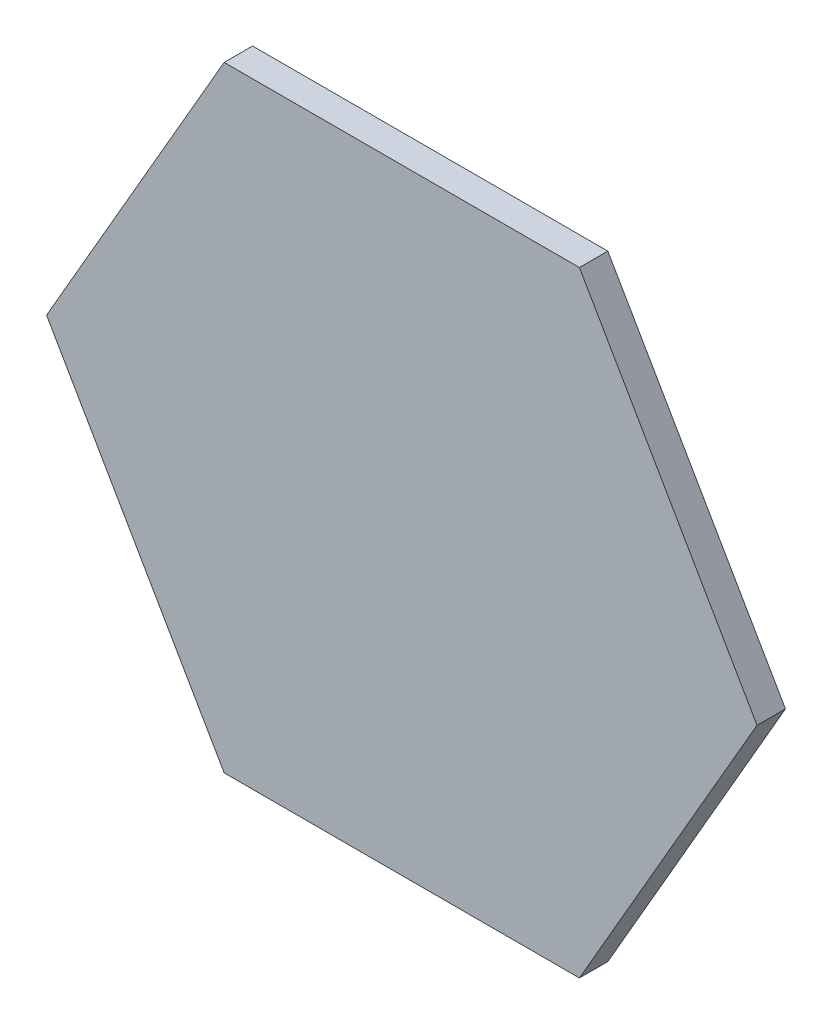
ISO-10303-21;
HEADER;
FILE_DESCRIPTION(('STEP AP214'),'2;1');
FILE_NAME('part.step','',(''),(''),'','','');
FILE_SCHEMA(('AUTOMOTIVE_DESIGN { 1 0 10303 214 1 1 1 1 }'));
ENDSEC;
DATA;
#1=APPLICATION_CONTEXT('core data for automotive mechanical design processes');
#2=APPLICATION_PROTOCOL_DEFINITION('international standard','automotive_design',2000,#1);
#3=PRODUCT_CONTEXT('',#1,'mechanical');
#4=PRODUCT('Part','Part','',(#3));
#5=PRODUCT_RELATED_PRODUCT_CATEGORY('part','',(#4));
#6=PRODUCT_DEFINITION_FORMATION('','',#4);
#7=PRODUCT_DEFINITION_CONTEXT('part definition',#1,'design');
#8=PRODUCT_DEFINITION('design','',#6,#7);
#9=PRODUCT_DEFINITION_SHAPE('','',#8);
#10=(LENGTH_UNIT() NAMED_UNIT(*) SI_UNIT(.MILLI.,.METRE.));
#11=(NAMED_UNIT(*) PLANE_ANGLE_UNIT() SI_UNIT($,.RADIAN.));
#12=(NAMED_UNIT(*) SI_UNIT($,.STERADIAN.) SOLID_ANGLE_UNIT());
#13=UNCERTAINTY_MEASURE_WITH_UNIT(LENGTH_MEASURE(1.E-05),#10,'distance_accuracy_value','');
#14=(GEOMETRIC_REPRESENTATION_CONTEXT(3) GLOBAL_UNCERTAINTY_ASSIGNED_CONTEXT((#13)) GLOBAL_UNIT_ASSIGNED_CONTEXT((#10,
#11,#12)) REPRESENTATION_CONTEXT('',''));
#15=CARTESIAN_POINT('',(0.,0.,0.));
#16=DIRECTION('',(0.,0.,1.));
#17=DIRECTION('',(1.,0.,0.));
#18=AXIS2_PLACEMENT_3D('',#15,#16,#17);
#19=CARTESIAN_POINT('',(-0.5,0.866025403784438,0.08));
#20=DIRECTION('',(0.866025403784439,-0.5,0.));
#21=DIRECTION('',(0.5,0.866025403784439,0.));
#22=AXIS2_PLACEMENT_3D('',#19,#20,#21);
#23=PLANE('',#22);
#24=DIRECTION('',(-0.5,-0.866025403784439,0.));
#25=VECTOR('',#24,1.);
#26=CARTESIAN_POINT('',(-0.5,0.866025403784438,0.));
#27=LINE('',#26,#25);
#28=CARTESIAN_POINT('',(-0.5,0.866025403784438,0.));
#29=VERTEX_POINT('',#28);
#30=CARTESIAN_POINT('',(-1.,0.,0.));
#31=VERTEX_POINT('',#30);
#32=EDGE_CURVE('E117',#29,#31,#27,.T.);
#33=ORIENTED_EDGE('',*,*,#32,.T.);
#34=DIRECTION('',(0.,0.,-1.));
#35=VECTOR('',#34,1.);
#36=CARTESIAN_POINT('',(-1.,0.,0.08));
#37=LINE('',#36,#35);
#38=CARTESIAN_POINT('',(-1.,0.,0.08));
#39=VERTEX_POINT('',#38);
#40=EDGE_CURVE('E11',#39,#31,#37,.T.);
#41=ORIENTED_EDGE('',*,*,#40,.F.);
#42=DIRECTION('',(-0.5,-0.866025403784439,0.));
#43=VECTOR('',#42,1.);
#44=CARTESIAN_POINT('',(-0.5,0.866025403784438,0.08));
#45=LINE('',#44,#43);
#46=CARTESIAN_POINT('',(-0.5,0.866025403784438,0.08));
#47=VERTEX_POINT('',#46);
#48=EDGE_CURVE('E127',#47,#39,#45,.T.);
#49=ORIENTED_EDGE('',*,*,#48,.F.);
#50=DIRECTION('',(0.,0.,-1.));
#51=VECTOR('',#50,1.);
#52=CARTESIAN_POINT('',(-0.5,0.866025403784438,0.08));
#53=LINE('',#52,#51);
#54=EDGE_CURVE('E113',#47,#29,#53,.T.);
#55=ORIENTED_EDGE('',*,*,#54,.T.);
#56=EDGE_LOOP('',(#33,#41,#49,#55));
#57=FACE_BOUND('',#56,.T.);
#58=ADVANCED_FACE('F33',(#57),#23,.F.);
#59=CARTESIAN_POINT('',(-1.,0.,0.08));
#60=DIRECTION('',(0.866025403784438,0.5,0.));
#61=DIRECTION('',(-0.5,0.866025403784438,0.));
#62=AXIS2_PLACEMENT_3D('',#59,#60,#61);
#63=PLANE('',#62);
#64=DIRECTION('',(0.5,-0.866025403784438,0.));
#65=VECTOR('',#64,1.);
#66=CARTESIAN_POINT('',(-1.,0.,0.));
#67=LINE('',#66,#65);
#68=CARTESIAN_POINT('',(-0.499999999999999,-0.866025403784439,0.));
#69=VERTEX_POINT('',#68);
#70=EDGE_CURVE('E120',#31,#69,#67,.T.);
#71=ORIENTED_EDGE('',*,*,#70,.T.);
#72=DIRECTION('',(0.,0.,-1.));
#73=VECTOR('',#72,1.);
#74=CARTESIAN_POINT('',(-0.499999999999999,-0.866025403784439,0.08));
#75=LINE('',#74,#73);
#76=CARTESIAN_POINT('',(-0.499999999999999,-0.866025403784439,0.08));
#77=VERTEX_POINT('',#76);
#78=EDGE_CURVE('E41',#77,#69,#75,.T.);
#79=ORIENTED_EDGE('',*,*,#78,.F.);
#80=DIRECTION('',(0.5,-0.866025403784438,0.));
#81=VECTOR('',#80,1.);
#82=CARTESIAN_POINT('',(-1.,0.,0.08));
#83=LINE('',#82,#81);
#84=EDGE_CURVE('E86',#39,#77,#83,.T.);
#85=ORIENTED_EDGE('',*,*,#84,.F.);
#86=ORIENTED_EDGE('',*,*,#40,.T.);
#87=EDGE_LOOP('',(#71,#79,#85,#86));
#88=FACE_BOUND('',#87,.T.);
#89=ADVANCED_FACE('F151',(#88),#63,.F.);
#90=CARTESIAN_POINT('',(-0.499999999999999,-0.866025403784439,0.08));
#91=DIRECTION('',(0.,1.,0.));
#92=DIRECTION('',(-1.,0.,0.));
#93=AXIS2_PLACEMENT_3D('',#90,#91,#92);
#94=PLANE('',#93);
#95=DIRECTION('',(1.,0.,0.));
#96=VECTOR('',#95,1.);
#97=CARTESIAN_POINT('',(-0.499999999999999,-0.866025403784439,0.));
#98=LINE('',#97,#96);
#99=CARTESIAN_POINT('',(0.5,-0.866025403784439,0.));
#100=VERTEX_POINT('',#99);
#101=EDGE_CURVE('E122',#69,#100,#98,.T.);
#102=ORIENTED_EDGE('',*,*,#101,.T.);
#103=DIRECTION('',(0.,0.,-1.));
#104=VECTOR('',#103,1.);
#105=CARTESIAN_POINT('',(0.5,-0.866025403784439,0.08));
#106=LINE('',#105,#104);
#107=CARTESIAN_POINT('',(0.5,-0.866025403784439,0.08));
#108=VERTEX_POINT('',#107);
#109=EDGE_CURVE('E108',#108,#100,#106,.T.);
#110=ORIENTED_EDGE('',*,*,#109,.F.);
#111=DIRECTION('',(1.,0.,0.));
#112=VECTOR('',#111,1.);
#113=CARTESIAN_POINT('',(-0.499999999999999,-0.866025403784439,0.08));
#114=LINE('',#113,#112);
#115=EDGE_CURVE('E99',#77,#108,#114,.T.);
#116=ORIENTED_EDGE('',*,*,#115,.F.);
#117=ORIENTED_EDGE('',*,*,#78,.T.);
#118=EDGE_LOOP('',(#102,#110,#116,#117));
#119=FACE_BOUND('',#118,.T.);
#120=ADVANCED_FACE('F133',(#119),#94,.F.);
#121=CARTESIAN_POINT('',(0.5,-0.866025403784439,0.08));
#122=DIRECTION('',(-0.866025403784439,0.5,0.));
#123=DIRECTION('',(-0.5,-0.866025403784439,0.));
#124=AXIS2_PLACEMENT_3D('',#121,#122,#123);
#125=PLANE('',#124);
#126=DIRECTION('',(0.5,0.866025403784439,0.));
#127=VECTOR('',#126,1.);
#128=CARTESIAN_POINT('',(0.5,-0.866025403784439,0.));
#129=LINE('',#128,#127);
#130=CARTESIAN_POINT('',(1.,0.,0.));
#131=VERTEX_POINT('',#130);
#132=EDGE_CURVE('E107',#100,#131,#129,.T.);
#133=ORIENTED_EDGE('',*,*,#132,.T.);
#134=DIRECTION('',(0.,0.,-1.));
#135=VECTOR('',#134,1.);
#136=CARTESIAN_POINT('',(1.,0.,0.08));
#137=LINE('',#136,#135);
#138=CARTESIAN_POINT('',(1.,0.,0.08));
#139=VERTEX_POINT('',#138);
#140=EDGE_CURVE('E104',#139,#131,#137,.T.);
#141=ORIENTED_EDGE('',*,*,#140,.F.);
#142=DIRECTION('',(0.5,0.866025403784439,0.));
#143=VECTOR('',#142,1.);
#144=CARTESIAN_POINT('',(0.5,-0.866025403784439,0.08));
#145=LINE('',#144,#143);
#146=EDGE_CURVE('E93',#108,#139,#145,.T.);
#147=ORIENTED_EDGE('',*,*,#146,.F.);
#148=ORIENTED_EDGE('',*,*,#109,.T.);
#149=EDGE_LOOP('',(#133,#141,#147,#148));
#150=FACE_BOUND('',#149,.T.);
#151=ADVANCED_FACE('F105',(#150),#125,.F.);
#152=CARTESIAN_POINT('',(1.,0.,0.08));
#153=DIRECTION('',(-0.866025403784439,-0.5,0.));
#154=DIRECTION('',(0.5,-0.866025403784439,0.));
#155=AXIS2_PLACEMENT_3D('',#152,#153,#154);
#156=PLANE('',#155);
#157=DIRECTION('',(-0.5,0.866025403784439,0.));
#158=VECTOR('',#157,1.);
#159=CARTESIAN_POINT('',(1.,0.,0.));
#160=LINE('',#159,#158);
#161=CARTESIAN_POINT('',(0.5,0.866025403784438,0.));
#162=VERTEX_POINT('',#161);
#163=EDGE_CURVE('E72',#131,#162,#160,.T.);
#164=ORIENTED_EDGE('',*,*,#163,.T.);
#165=DIRECTION('',(0.,0.,-1.));
#166=VECTOR('',#165,1.);
#167=CARTESIAN_POINT('',(0.5,0.866025403784438,0.08));
#168=LINE('',#167,#166);
#169=CARTESIAN_POINT('',(0.5,0.866025403784438,0.08));
#170=VERTEX_POINT('',#169);
#171=EDGE_CURVE('E109',#170,#162,#168,.T.);
#172=ORIENTED_EDGE('',*,*,#171,.F.);
#173=DIRECTION('',(-0.5,0.866025403784439,0.));
#174=VECTOR('',#173,1.);
#175=CARTESIAN_POINT('',(1.,0.,0.08));
#176=LINE('',#175,#174);
#177=EDGE_CURVE('E97',#139,#170,#176,.T.);
#178=ORIENTED_EDGE('',*,*,#177,.F.);
#179=ORIENTED_EDGE('',*,*,#140,.T.);
#180=EDGE_LOOP('',(#164,#172,#178,#179));
#181=FACE_BOUND('',#180,.T.);
#182=ADVANCED_FACE('F111',(#181),#156,.F.);
#183=CARTESIAN_POINT('',(0.5,0.866025403784438,0.08));
#184=DIRECTION('',(0.,-1.,0.));
#185=DIRECTION('',(0.,0.,-1.));
#186=AXIS2_PLACEMENT_3D('',#183,#184,#185);
#187=PLANE('',#186);
#188=DIRECTION('',(-1.,0.,0.));
#189=VECTOR('',#188,1.);
#190=CARTESIAN_POINT('',(0.5,0.866025403784438,0.));
#191=LINE('',#190,#189);
#192=EDGE_CURVE('E78',#162,#29,#191,.T.);
#193=ORIENTED_EDGE('',*,*,#192,.T.);
#194=ORIENTED_EDGE('',*,*,#54,.F.);
#195=DIRECTION('',(-1.,0.,0.));
#196=VECTOR('',#195,1.);
#197=CARTESIAN_POINT('',(0.5,0.866025403784438,0.08));
#198=LINE('',#197,#196);
#199=EDGE_CURVE('E49',#170,#47,#198,.T.);
#200=ORIENTED_EDGE('',*,*,#199,.F.);
#201=ORIENTED_EDGE('',*,*,#171,.T.);
#202=EDGE_LOOP('',(#193,#194,#200,#201));
#203=FACE_BOUND('',#202,.T.);
#204=ADVANCED_FACE('F140',(#203),#187,.F.);
#205=CARTESIAN_POINT('',(0.,0.,0.08));
#206=DIRECTION('',(0.,0.,1.));
#207=DIRECTION('',(1.,0.,0.));
#208=AXIS2_PLACEMENT_3D('',#205,#206,#207);
#209=PLANE('',#208);
#210=ORIENTED_EDGE('',*,*,#48,.T.);
#211=ORIENTED_EDGE('',*,*,#84,.T.);
#212=ORIENTED_EDGE('',*,*,#115,.T.);
#213=ORIENTED_EDGE('',*,*,#146,.T.);
#214=ORIENTED_EDGE('',*,*,#177,.T.);
#215=ORIENTED_EDGE('',*,*,#199,.T.);
#216=EDGE_LOOP('',(#210,#211,#212,#213,#214,#215));
#217=FACE_BOUND('',#216,.T.);
#218=ADVANCED_FACE('F95',(#217),#209,.T.);
#219=CARTESIAN_POINT('',(0.,0.,0.));
#220=DIRECTION('',(0.,0.,1.));
#221=DIRECTION('',(1.,0.,0.));
#222=AXIS2_PLACEMENT_3D('',#219,#220,#221);
#223=PLANE('',#222);
#224=ORIENTED_EDGE('',*,*,#32,.F.);
#225=ORIENTED_EDGE('',*,*,#192,.F.);
#226=ORIENTED_EDGE('',*,*,#163,.F.);
#227=ORIENTED_EDGE('',*,*,#132,.F.);
#228=ORIENTED_EDGE('',*,*,#101,.F.);
#229=ORIENTED_EDGE('',*,*,#70,.F.);
#230=EDGE_LOOP('',(#224,#225,#226,#227,#228,#229));
#231=FACE_BOUND('',#230,.T.);
#232=ADVANCED_FACE('F136',(#231),#223,.F.);
#233=CLOSED_SHELL('',(#58,#89,#120,#151,#182,#204,#218,#232));
#234=MANIFOLD_SOLID_BREP('B2',#233);
#235=ADVANCED_BREP_SHAPE_REPRESENTATION('',(#18,#234),#14);
#236=SHAPE_DEFINITION_REPRESENTATION(#9,#235);
ENDSEC;
END-ISO-10303-21;
